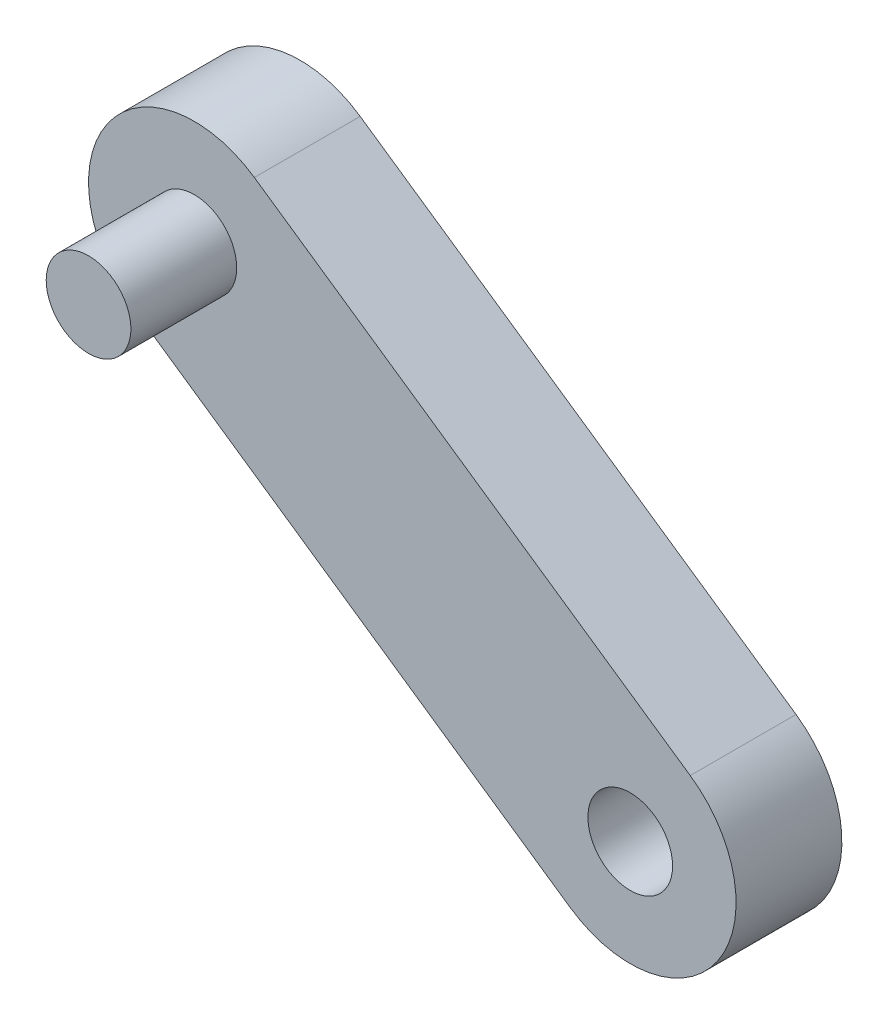
ISO-10303-21;
HEADER;
FILE_DESCRIPTION(('STEP AP214'),'2;1');
FILE_NAME('part.step','',(''),(''),'','','');
FILE_SCHEMA(('AUTOMOTIVE_DESIGN { 1 0 10303 214 1 1 1 1 }'));
ENDSEC;
DATA;
#1=APPLICATION_CONTEXT('core data for automotive mechanical design processes');
#2=APPLICATION_PROTOCOL_DEFINITION('international standard','automotive_design',2000,#1);
#3=PRODUCT_CONTEXT('',#1,'mechanical');
#4=PRODUCT('Part','Part','',(#3));
#5=PRODUCT_RELATED_PRODUCT_CATEGORY('part','',(#4));
#6=PRODUCT_DEFINITION_FORMATION('','',#4);
#7=PRODUCT_DEFINITION_CONTEXT('part definition',#1,'design');
#8=PRODUCT_DEFINITION('design','',#6,#7);
#9=PRODUCT_DEFINITION_SHAPE('','',#8);
#10=(LENGTH_UNIT() NAMED_UNIT(*) SI_UNIT(.MILLI.,.METRE.));
#11=(NAMED_UNIT(*) PLANE_ANGLE_UNIT() SI_UNIT($,.RADIAN.));
#12=(NAMED_UNIT(*) SI_UNIT($,.STERADIAN.) SOLID_ANGLE_UNIT());
#13=UNCERTAINTY_MEASURE_WITH_UNIT(LENGTH_MEASURE(1.E-05),#10,'distance_accuracy_value','');
#14=(GEOMETRIC_REPRESENTATION_CONTEXT(3) GLOBAL_UNCERTAINTY_ASSIGNED_CONTEXT((#13)) GLOBAL_UNIT_ASSIGNED_CONTEXT((#10,
#11,#12)) REPRESENTATION_CONTEXT('',''));
#15=CARTESIAN_POINT('',(0.,0.,0.));
#16=DIRECTION('',(0.,0.,1.));
#17=DIRECTION('',(1.,0.,0.));
#18=AXIS2_PLACEMENT_3D('',#15,#16,#17);
#19=CARTESIAN_POINT('',(-44.3801418640162,84.6953489238267,10.));
#20=DIRECTION('',(0.,0.,-1.));
#21=DIRECTION('',(-1.,0.,0.));
#22=AXIS2_PLACEMENT_3D('',#19,#20,#21);
#23=CYLINDRICAL_SURFACE('',#22,2.);
#24=CARTESIAN_POINT('',(-44.3801418640162,84.6953489238267,10.));
#25=DIRECTION('',(0.,0.,-1.));
#26=DIRECTION('',(-1.,0.,0.));
#27=AXIS2_PLACEMENT_3D('',#24,#25,#26);
#28=CIRCLE('',#27,2.);
#29=CARTESIAN_POINT('',(-46.3801418640162,84.6953489238267,10.));
#30=VERTEX_POINT('',#29);
#31=EDGE_CURVE('E11',#30,#30,#28,.T.);
#32=ORIENTED_EDGE('',*,*,#31,.T.);
#33=EDGE_LOOP('',(#32));
#34=FACE_BOUND('',#33,.T.);
#35=CARTESIAN_POINT('',(-44.3801418640162,84.6953489238267,0.));
#36=DIRECTION('',(0.,0.,-1.));
#37=DIRECTION('',(-1.,0.,0.));
#38=AXIS2_PLACEMENT_3D('',#35,#36,#37);
#39=CIRCLE('',#38,2.);
#40=CARTESIAN_POINT('',(-46.3801418640162,84.6953489238267,0.));
#41=VERTEX_POINT('',#40);
#42=EDGE_CURVE('E47',#41,#41,#39,.T.);
#43=ORIENTED_EDGE('',*,*,#42,.F.);
#44=EDGE_LOOP('',(#43));
#45=FACE_BOUND('',#44,.T.);
#46=ADVANCED_FACE('F44',(#34,#45),#23,.T.);
#47=CARTESIAN_POINT('',(-44.3801418640162,84.6953489238267,10.));
#48=DIRECTION('',(0.,0.,-1.));
#49=DIRECTION('',(-1.,0.,0.));
#50=AXIS2_PLACEMENT_3D('',#47,#48,#49);
#51=PLANE('',#50);
#52=ORIENTED_EDGE('',*,*,#31,.F.);
#53=EDGE_LOOP('',(#52));
#54=FACE_BOUND('',#53,.T.);
#55=ADVANCED_FACE('F59',(#54),#51,.F.);
#56=CARTESIAN_POINT('',(-44.3801418640162,84.6953489238267,0.));
#57=DIRECTION('',(0.,0.,-1.));
#58=DIRECTION('',(-1.,0.,0.));
#59=AXIS2_PLACEMENT_3D('',#56,#57,#58);
#60=PLANE('',#59);
#61=ORIENTED_EDGE('',*,*,#42,.T.);
#62=EDGE_LOOP('',(#61));
#63=FACE_BOUND('',#62,.T.);
#64=ADVANCED_FACE('F56',(#63),#60,.T.);
#65=CLOSED_SHELL('',(#46,#55,#64));
#66=MANIFOLD_SOLID_BREP('B2',#65);
#67=CARTESIAN_POINT('',(22.4546862512256,32.6242146663216,5.));
#68=DIRECTION('',(0.566966615087807,0.823740770737903,0.));
#69=DIRECTION('',(-0.823740770737903,0.566966615087807,0.));
#70=AXIS2_PLACEMENT_3D('',#67,#68,#69);
#71=PLANE('',#70);
#72=DIRECTION('',(0.823740770737903,-0.566966615087807,0.));
#73=VECTOR('',#72,1.);
#74=CARTESIAN_POINT('',(22.4546862512256,32.6242146663216,0.));
#75=LINE('',#74,#73);
#76=CARTESIAN_POINT('',(-47.2149749394553,80.5766450701372,0.));
#77=VERTEX_POINT('',#76);
#78=CARTESIAN_POINT('',(-26.6214556710077,66.402479692942,0.));
#79=VERTEX_POINT('',#78);
#80=EDGE_CURVE('E153',#77,#79,#75,.T.);
#81=ORIENTED_EDGE('',*,*,#80,.T.);
#82=DIRECTION('',(0.,0.,-1.));
#83=VECTOR('',#82,1.);
#84=CARTESIAN_POINT('',(-26.6214556710077,66.402479692942,5.));
#85=LINE('',#84,#83);
#86=CARTESIAN_POINT('',(-26.6214556710077,66.402479692942,5.));
#87=VERTEX_POINT('',#86);
#88=EDGE_CURVE('E42',#87,#79,#85,.T.);
#89=ORIENTED_EDGE('',*,*,#88,.F.);
#90=DIRECTION('',(0.823740770737903,-0.566966615087807,0.));
#91=VECTOR('',#90,1.);
#92=CARTESIAN_POINT('',(22.4546862512256,32.6242146663216,5.));
#93=LINE('',#92,#91);
#94=CARTESIAN_POINT('',(-47.2149749394553,80.5766450701372,5.));
#95=VERTEX_POINT('',#94);
#96=EDGE_CURVE('E132',#95,#87,#93,.T.);
#97=ORIENTED_EDGE('',*,*,#96,.F.);
#98=DIRECTION('',(0.,0.,-1.));
#99=VECTOR('',#98,1.);
#100=CARTESIAN_POINT('',(-47.2149749394553,80.5766450701372,5.));
#101=LINE('',#100,#99);
#102=EDGE_CURVE('E143',#95,#77,#101,.T.);
#103=ORIENTED_EDGE('',*,*,#102,.T.);
#104=EDGE_LOOP('',(#81,#89,#97,#103));
#105=FACE_BOUND('',#104,.T.);
#106=ADVANCED_FACE('F84',(#105),#71,.F.);
#107=CARTESIAN_POINT('',(-23.7866225955687,70.5211835466315,5.));
#108=DIRECTION('',(0.,0.,-1.));
#109=DIRECTION('',(-1.,0.,0.));
#110=AXIS2_PLACEMENT_3D('',#107,#108,#109);
#111=CYLINDRICAL_SURFACE('',#110,4.99999999999997);
#112=CARTESIAN_POINT('',(-23.7866225955687,70.5211835466315,0.));
#113=DIRECTION('',(0.,0.,1.));
#114=DIRECTION('',(1.,0.,0.));
#115=AXIS2_PLACEMENT_3D('',#112,#113,#114);
#116=CIRCLE('',#115,4.99999999999997);
#117=CARTESIAN_POINT('',(-20.9517895201297,74.639887400321,0.));
#118=VERTEX_POINT('',#117);
#119=EDGE_CURVE('E137',#79,#118,#116,.T.);
#120=ORIENTED_EDGE('',*,*,#119,.T.);
#121=DIRECTION('',(0.,0.,-1.));
#122=VECTOR('',#121,1.);
#123=CARTESIAN_POINT('',(-20.9517895201297,74.639887400321,5.));
#124=LINE('',#123,#122);
#125=CARTESIAN_POINT('',(-20.9517895201297,74.639887400321,5.));
#126=VERTEX_POINT('',#125);
#127=EDGE_CURVE('E93',#126,#118,#124,.T.);
#128=ORIENTED_EDGE('',*,*,#127,.F.);
#129=CARTESIAN_POINT('',(-23.7866225955687,70.5211835466315,5.));
#130=DIRECTION('',(0.,0.,1.));
#131=DIRECTION('',(1.,0.,0.));
#132=AXIS2_PLACEMENT_3D('',#129,#130,#131);
#133=CIRCLE('',#132,4.99999999999997);
#134=EDGE_CURVE('E127',#87,#126,#133,.T.);
#135=ORIENTED_EDGE('',*,*,#134,.F.);
#136=ORIENTED_EDGE('',*,*,#88,.T.);
#137=EDGE_LOOP('',(#120,#128,#135,#136));
#138=FACE_BOUND('',#137,.T.);
#139=ADVANCED_FACE('F136',(#138),#111,.T.);
#140=CARTESIAN_POINT('',(28.1243524021036,40.8616223737004,5.));
#141=DIRECTION('',(0.56696661508781,0.823740770737901,0.));
#142=DIRECTION('',(-0.823740770737901,0.56696661508781,0.));
#143=AXIS2_PLACEMENT_3D('',#140,#141,#142);
#144=PLANE('',#143);
#145=DIRECTION('',(0.823740770737901,-0.56696661508781,0.));
#146=VECTOR('',#145,1.);
#147=CARTESIAN_POINT('',(28.1243524021036,40.8616223737004,0.));
#148=LINE('',#147,#146);
#149=CARTESIAN_POINT('',(-41.5453087885772,88.8140527775162,0.));
#150=VERTEX_POINT('',#149);
#151=EDGE_CURVE('E157',#150,#118,#148,.T.);
#152=ORIENTED_EDGE('',*,*,#151,.F.);
#153=DIRECTION('',(0.,0.,-1.));
#154=VECTOR('',#153,1.);
#155=CARTESIAN_POINT('',(-41.5453087885772,88.8140527775162,5.));
#156=LINE('',#155,#154);
#157=CARTESIAN_POINT('',(-41.5453087885772,88.8140527775162,5.));
#158=VERTEX_POINT('',#157);
#159=EDGE_CURVE('E117',#158,#150,#156,.T.);
#160=ORIENTED_EDGE('',*,*,#159,.F.);
#161=DIRECTION('',(0.823740770737901,-0.56696661508781,0.));
#162=VECTOR('',#161,1.);
#163=CARTESIAN_POINT('',(28.1243524021036,40.8616223737004,5.));
#164=LINE('',#163,#162);
#165=EDGE_CURVE('E130',#158,#126,#164,.T.);
#166=ORIENTED_EDGE('',*,*,#165,.T.);
#167=ORIENTED_EDGE('',*,*,#127,.T.);
#168=EDGE_LOOP('',(#152,#160,#166,#167));
#169=FACE_BOUND('',#168,.T.);
#170=ADVANCED_FACE('F141',(#169),#144,.T.);
#171=CARTESIAN_POINT('',(-44.3801418640162,84.6953489238267,5.));
#172=DIRECTION('',(0.,0.,-1.));
#173=DIRECTION('',(-1.,0.,0.));
#174=AXIS2_PLACEMENT_3D('',#171,#172,#173);
#175=CYLINDRICAL_SURFACE('',#174,2.);
#176=CARTESIAN_POINT('',(-44.3801418640162,84.6953489238267,5.));
#177=DIRECTION('',(0.,0.,1.));
#178=DIRECTION('',(1.,0.,0.));
#179=AXIS2_PLACEMENT_3D('',#176,#177,#178);
#180=CIRCLE('',#179,2.);
#181=CARTESIAN_POINT('',(-42.3801418640162,84.6953489238267,5.));
#182=VERTEX_POINT('',#181);
#183=EDGE_CURVE('E195',#182,#182,#180,.T.);
#184=ORIENTED_EDGE('',*,*,#183,.T.);
#185=EDGE_LOOP('',(#184));
#186=FACE_BOUND('',#185,.T.);
#187=CARTESIAN_POINT('',(-44.3801418640162,84.6953489238267,0.));
#188=DIRECTION('',(0.,0.,1.));
#189=DIRECTION('',(1.,0.,0.));
#190=AXIS2_PLACEMENT_3D('',#187,#188,#189);
#191=CIRCLE('',#190,2.);
#192=CARTESIAN_POINT('',(-42.3801418640162,84.6953489238267,0.));
#193=VERTEX_POINT('',#192);
#194=EDGE_CURVE('E150',#193,#193,#191,.T.);
#195=ORIENTED_EDGE('',*,*,#194,.F.);
#196=EDGE_LOOP('',(#195));
#197=FACE_BOUND('',#196,.T.);
#198=ADVANCED_FACE('F184',(#186,#197),#175,.F.);
#199=CARTESIAN_POINT('',(-23.7866225955687,70.5211835466315,5.));
#200=DIRECTION('',(0.,0.,-1.));
#201=DIRECTION('',(-1.,0.,0.));
#202=AXIS2_PLACEMENT_3D('',#199,#200,#201);
#203=CYLINDRICAL_SURFACE('',#202,2.00000000000001);
#204=CARTESIAN_POINT('',(-23.7866225955687,70.5211835466315,5.));
#205=DIRECTION('',(0.,0.,1.));
#206=DIRECTION('',(1.,0.,0.));
#207=AXIS2_PLACEMENT_3D('',#204,#205,#206);
#208=CIRCLE('',#207,2.00000000000001);
#209=CARTESIAN_POINT('',(-21.7866225955687,70.5211835466315,5.));
#210=VERTEX_POINT('',#209);
#211=EDGE_CURVE('E160',#210,#210,#208,.T.);
#212=ORIENTED_EDGE('',*,*,#211,.T.);
#213=EDGE_LOOP('',(#212));
#214=FACE_BOUND('',#213,.T.);
#215=CARTESIAN_POINT('',(-23.7866225955687,70.5211835466315,0.));
#216=DIRECTION('',(0.,0.,1.));
#217=DIRECTION('',(1.,0.,0.));
#218=AXIS2_PLACEMENT_3D('',#215,#216,#217);
#219=CIRCLE('',#218,2.00000000000001);
#220=CARTESIAN_POINT('',(-21.7866225955687,70.5211835466315,0.));
#221=VERTEX_POINT('',#220);
#222=EDGE_CURVE('E147',#221,#221,#219,.T.);
#223=ORIENTED_EDGE('',*,*,#222,.F.);
#224=EDGE_LOOP('',(#223));
#225=FACE_BOUND('',#224,.T.);
#226=ADVANCED_FACE('F86',(#214,#225),#203,.F.);
#227=CARTESIAN_POINT('',(-44.3801418640162,84.6953489238267,5.));
#228=DIRECTION('',(0.,0.,-1.));
#229=DIRECTION('',(-1.,0.,0.));
#230=AXIS2_PLACEMENT_3D('',#227,#228,#229);
#231=CYLINDRICAL_SURFACE('',#230,5.);
#232=CARTESIAN_POINT('',(-44.3801418640162,84.6953489238267,0.));
#233=DIRECTION('',(0.,0.,1.));
#234=DIRECTION('',(1.,0.,0.));
#235=AXIS2_PLACEMENT_3D('',#232,#233,#234);
#236=CIRCLE('',#235,5.);
#237=EDGE_CURVE('E120',#150,#77,#236,.T.);
#238=ORIENTED_EDGE('',*,*,#237,.T.);
#239=ORIENTED_EDGE('',*,*,#102,.F.);
#240=CARTESIAN_POINT('',(-44.3801418640162,84.6953489238267,5.));
#241=DIRECTION('',(0.,0.,1.));
#242=DIRECTION('',(1.,0.,0.));
#243=AXIS2_PLACEMENT_3D('',#240,#241,#242);
#244=CIRCLE('',#243,5.);
#245=EDGE_CURVE('E101',#158,#95,#244,.T.);
#246=ORIENTED_EDGE('',*,*,#245,.F.);
#247=ORIENTED_EDGE('',*,*,#159,.T.);
#248=EDGE_LOOP('',(#238,#239,#246,#247));
#249=FACE_BOUND('',#248,.T.);
#250=ADVANCED_FACE('F172',(#249),#231,.T.);
#251=CARTESIAN_POINT('',(0.,0.,5.));
#252=DIRECTION('',(0.,0.,1.));
#253=DIRECTION('',(1.,0.,0.));
#254=AXIS2_PLACEMENT_3D('',#251,#252,#253);
#255=PLANE('',#254);
#256=ORIENTED_EDGE('',*,*,#211,.F.);
#257=EDGE_LOOP('',(#256));
#258=FACE_BOUND('',#257,.T.);
#259=ORIENTED_EDGE('',*,*,#183,.F.);
#260=EDGE_LOOP('',(#259));
#261=FACE_BOUND('',#260,.T.);
#262=ORIENTED_EDGE('',*,*,#96,.T.);
#263=ORIENTED_EDGE('',*,*,#134,.T.);
#264=ORIENTED_EDGE('',*,*,#165,.F.);
#265=ORIENTED_EDGE('',*,*,#245,.T.);
#266=EDGE_LOOP('',(#262,#263,#264,#265));
#267=FACE_BOUND('',#266,.T.);
#268=ADVANCED_FACE('F128',(#258,#261,#267),#255,.T.);
#269=CARTESIAN_POINT('',(0.,0.,0.));
#270=DIRECTION('',(0.,0.,1.));
#271=DIRECTION('',(1.,0.,0.));
#272=AXIS2_PLACEMENT_3D('',#269,#270,#271);
#273=PLANE('',#272);
#274=ORIENTED_EDGE('',*,*,#222,.T.);
#275=EDGE_LOOP('',(#274));
#276=FACE_BOUND('',#275,.T.);
#277=ORIENTED_EDGE('',*,*,#194,.T.);
#278=EDGE_LOOP('',(#277));
#279=FACE_BOUND('',#278,.T.);
#280=ORIENTED_EDGE('',*,*,#80,.F.);
#281=ORIENTED_EDGE('',*,*,#237,.F.);
#282=ORIENTED_EDGE('',*,*,#151,.T.);
#283=ORIENTED_EDGE('',*,*,#119,.F.);
#284=EDGE_LOOP('',(#280,#281,#282,#283));
#285=FACE_BOUND('',#284,.T.);
#286=ADVANCED_FACE('F165',(#276,#279,#285),#273,.F.);
#287=CLOSED_SHELL('',(#106,#139,#170,#198,#226,#250,#268,#286));
#288=MANIFOLD_SOLID_BREP('B6',#287);
#289=ADVANCED_BREP_SHAPE_REPRESENTATION('',(#18,#66,#288),#14);
#290=SHAPE_DEFINITION_REPRESENTATION(#9,#289);
ENDSEC;
END-ISO-10303-21;
